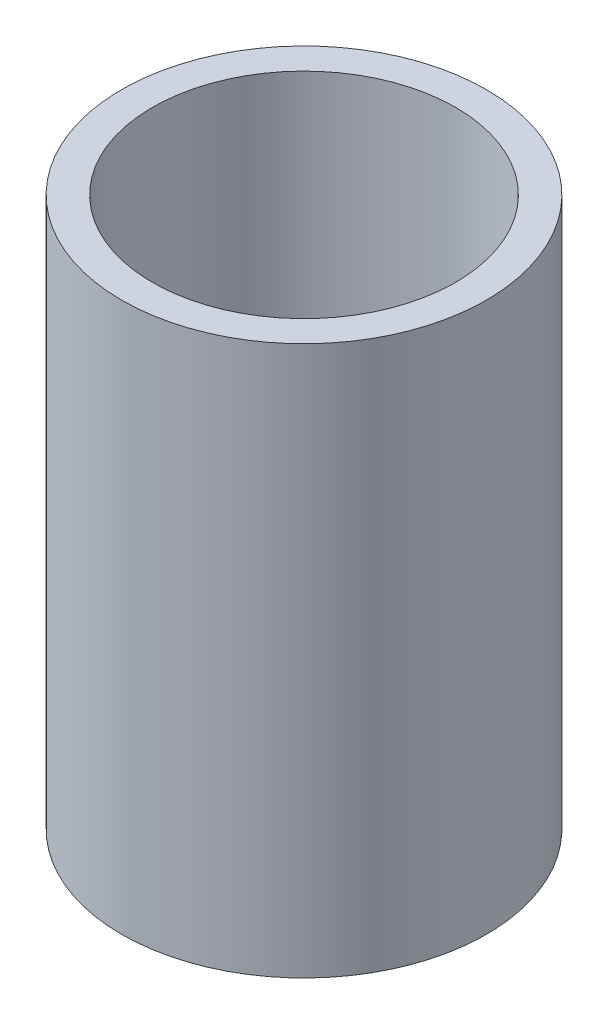
ISO-10303-21;
HEADER;
FILE_DESCRIPTION(('STEP AP214'),'2;1');
FILE_NAME('part.step','',(''),(''),'','','');
FILE_SCHEMA(('AUTOMOTIVE_DESIGN { 1 0 10303 214 1 1 1 1 }'));
ENDSEC;
DATA;
#1=APPLICATION_CONTEXT('core data for automotive mechanical design processes');
#2=APPLICATION_PROTOCOL_DEFINITION('international standard','automotive_design',2000,#1);
#3=PRODUCT_CONTEXT('',#1,'mechanical');
#4=PRODUCT('Part','Part','',(#3));
#5=PRODUCT_RELATED_PRODUCT_CATEGORY('part','',(#4));
#6=PRODUCT_DEFINITION_FORMATION('','',#4);
#7=PRODUCT_DEFINITION_CONTEXT('part definition',#1,'design');
#8=PRODUCT_DEFINITION('design','',#6,#7);
#9=PRODUCT_DEFINITION_SHAPE('','',#8);
#10=(LENGTH_UNIT() NAMED_UNIT(*) SI_UNIT(.MILLI.,.METRE.));
#11=(NAMED_UNIT(*) PLANE_ANGLE_UNIT() SI_UNIT($,.RADIAN.));
#12=(NAMED_UNIT(*) SI_UNIT($,.STERADIAN.) SOLID_ANGLE_UNIT());
#13=UNCERTAINTY_MEASURE_WITH_UNIT(LENGTH_MEASURE(1.E-05),#10,'distance_accuracy_value','');
#14=(GEOMETRIC_REPRESENTATION_CONTEXT(3) GLOBAL_UNCERTAINTY_ASSIGNED_CONTEXT((#13)) GLOBAL_UNIT_ASSIGNED_CONTEXT((#10,
#11,#12)) REPRESENTATION_CONTEXT('',''));
#15=CARTESIAN_POINT('',(0.,0.,0.));
#16=DIRECTION('',(0.,0.,1.));
#17=DIRECTION('',(1.,0.,0.));
#18=AXIS2_PLACEMENT_3D('',#15,#16,#17);
#19=CARTESIAN_POINT('',(0.,63.5,0.));
#20=DIRECTION('',(0.,1.,0.));
#21=DIRECTION('',(0.,0.,-1.));
#22=AXIS2_PLACEMENT_3D('',#19,#20,#21);
#23=PLANE('',#22);
#24=CARTESIAN_POINT('',(0.,63.5,0.));
#25=DIRECTION('',(0.,-1.,0.));
#26=DIRECTION('',(0.,0.,-1.));
#27=AXIS2_PLACEMENT_3D('',#24,#25,#26);
#28=CIRCLE('',#27,21.082);
#29=CARTESIAN_POINT('',(0.,63.5,-21.082));
#30=VERTEX_POINT('',#29);
#31=EDGE_CURVE('E10',#30,#30,#28,.T.);
#32=ORIENTED_EDGE('',*,*,#31,.F.);
#33=EDGE_LOOP('',(#32));
#34=FACE_BOUND('',#33,.T.);
#35=CARTESIAN_POINT('',(0.,63.5,0.));
#36=DIRECTION('',(0.,-1.,0.));
#37=DIRECTION('',(0.,0.,-1.));
#38=AXIS2_PLACEMENT_3D('',#35,#36,#37);
#39=CIRCLE('',#38,17.526);
#40=CARTESIAN_POINT('',(0.,63.5,-17.526));
#41=VERTEX_POINT('',#40);
#42=EDGE_CURVE('E44',#41,#41,#39,.T.);
#43=ORIENTED_EDGE('',*,*,#42,.T.);
#44=EDGE_LOOP('',(#43));
#45=FACE_BOUND('',#44,.T.);
#46=ADVANCED_FACE('F33',(#34,#45),#23,.T.);
#47=CARTESIAN_POINT('',(0.,0.,0.));
#48=DIRECTION('',(0.,1.,0.));
#49=DIRECTION('',(0.,0.,-1.));
#50=AXIS2_PLACEMENT_3D('',#47,#48,#49);
#51=PLANE('',#50);
#52=CARTESIAN_POINT('',(0.,0.,0.));
#53=DIRECTION('',(0.,-1.,0.));
#54=DIRECTION('',(0.,0.,-1.));
#55=AXIS2_PLACEMENT_3D('',#52,#53,#54);
#56=CIRCLE('',#55,21.082);
#57=CARTESIAN_POINT('',(0.,0.,-21.082));
#58=VERTEX_POINT('',#57);
#59=EDGE_CURVE('E37',#58,#58,#56,.T.);
#60=ORIENTED_EDGE('',*,*,#59,.T.);
#61=EDGE_LOOP('',(#60));
#62=FACE_BOUND('',#61,.T.);
#63=CARTESIAN_POINT('',(0.,0.,0.));
#64=DIRECTION('',(0.,-1.,0.));
#65=DIRECTION('',(0.,0.,-1.));
#66=AXIS2_PLACEMENT_3D('',#63,#64,#65);
#67=CIRCLE('',#66,17.526);
#68=CARTESIAN_POINT('',(0.,0.,-17.526));
#69=VERTEX_POINT('',#68);
#70=EDGE_CURVE('E46',#69,#69,#67,.T.);
#71=ORIENTED_EDGE('',*,*,#70,.F.);
#72=EDGE_LOOP('',(#71));
#73=FACE_BOUND('',#72,.T.);
#74=ADVANCED_FACE('F59',(#62,#73),#51,.F.);
#75=CARTESIAN_POINT('',(0.,63.5,0.));
#76=DIRECTION('',(0.,-1.,0.));
#77=DIRECTION('',(0.,0.,1.));
#78=AXIS2_PLACEMENT_3D('',#75,#76,#77);
#79=CYLINDRICAL_SURFACE('',#78,21.082);
#80=ORIENTED_EDGE('',*,*,#31,.T.);
#81=EDGE_LOOP('',(#80));
#82=FACE_BOUND('',#81,.T.);
#83=ORIENTED_EDGE('',*,*,#59,.F.);
#84=EDGE_LOOP('',(#83));
#85=FACE_BOUND('',#84,.T.);
#86=ADVANCED_FACE('F35',(#82,#85),#79,.T.);
#87=CARTESIAN_POINT('',(0.,63.5,0.));
#88=DIRECTION('',(0.,-1.,0.));
#89=DIRECTION('',(0.,0.,1.));
#90=AXIS2_PLACEMENT_3D('',#87,#88,#89);
#91=CYLINDRICAL_SURFACE('',#90,17.526);
#92=ORIENTED_EDGE('',*,*,#42,.F.);
#93=EDGE_LOOP('',(#92));
#94=FACE_BOUND('',#93,.T.);
#95=ORIENTED_EDGE('',*,*,#70,.T.);
#96=EDGE_LOOP('',(#95));
#97=FACE_BOUND('',#96,.T.);
#98=ADVANCED_FACE('F53',(#94,#97),#91,.F.);
#99=CLOSED_SHELL('',(#46,#74,#86,#98));
#100=MANIFOLD_SOLID_BREP('B2',#99);
#101=ADVANCED_BREP_SHAPE_REPRESENTATION('',(#18,#100),#14);
#102=SHAPE_DEFINITION_REPRESENTATION(#9,#101);
ENDSEC;
END-ISO-10303-21;
